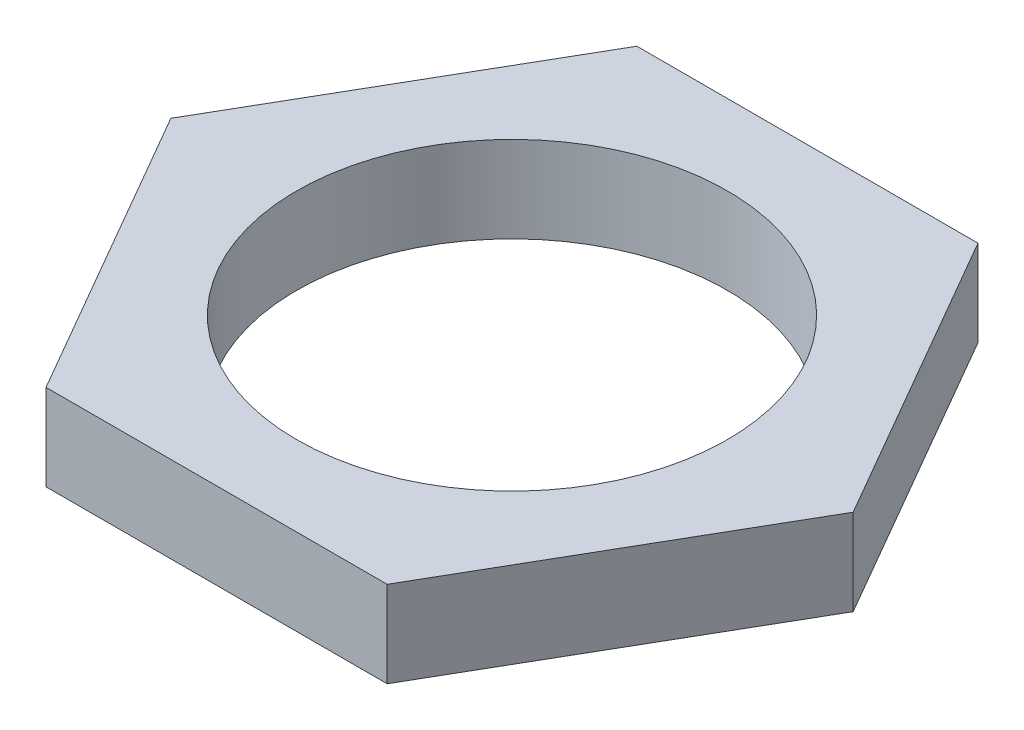
ISO-10303-21;
HEADER;
FILE_DESCRIPTION(('STEP AP214'),'2;1');
FILE_NAME('part.step','',(''),(''),'','','');
FILE_SCHEMA(('AUTOMOTIVE_DESIGN { 1 0 10303 214 1 1 1 1 }'));
ENDSEC;
DATA;
#1=APPLICATION_CONTEXT('core data for automotive mechanical design processes');
#2=APPLICATION_PROTOCOL_DEFINITION('international standard','automotive_design',2000,#1);
#3=PRODUCT_CONTEXT('',#1,'mechanical');
#4=PRODUCT('Part','Part','',(#3));
#5=PRODUCT_RELATED_PRODUCT_CATEGORY('part','',(#4));
#6=PRODUCT_DEFINITION_FORMATION('','',#4);
#7=PRODUCT_DEFINITION_CONTEXT('part definition',#1,'design');
#8=PRODUCT_DEFINITION('design','',#6,#7);
#9=PRODUCT_DEFINITION_SHAPE('','',#8);
#10=(LENGTH_UNIT() NAMED_UNIT(*) SI_UNIT(.MILLI.,.METRE.));
#11=(NAMED_UNIT(*) PLANE_ANGLE_UNIT() SI_UNIT($,.RADIAN.));
#12=(NAMED_UNIT(*) SI_UNIT($,.STERADIAN.) SOLID_ANGLE_UNIT());
#13=UNCERTAINTY_MEASURE_WITH_UNIT(LENGTH_MEASURE(1.E-05),#10,'distance_accuracy_value','');
#14=(GEOMETRIC_REPRESENTATION_CONTEXT(3) GLOBAL_UNCERTAINTY_ASSIGNED_CONTEXT((#13)) GLOBAL_UNIT_ASSIGNED_CONTEXT((#10,
#11,#12)) REPRESENTATION_CONTEXT('',''));
#15=CARTESIAN_POINT('',(0.,0.,0.));
#16=DIRECTION('',(0.,0.,1.));
#17=DIRECTION('',(1.,0.,0.));
#18=AXIS2_PLACEMENT_3D('',#15,#16,#17);
#19=CARTESIAN_POINT('',(0.,3.5,0.));
#20=DIRECTION('',(0.,1.,0.));
#21=DIRECTION('',(0.,0.,1.));
#22=AXIS2_PLACEMENT_3D('',#19,#20,#21);
#23=PLANE('',#22);
#24=DIRECTION('',(0.5,0.,0.866025403784438));
#25=VECTOR('',#24,1.);
#26=CARTESIAN_POINT('',(-13.856406460551,3.5,0.));
#27=LINE('',#26,#25);
#28=CARTESIAN_POINT('',(-13.856406460551,3.5,0.));
#29=VERTEX_POINT('',#28);
#30=CARTESIAN_POINT('',(-6.92820323027551,3.5,12.));
#31=VERTEX_POINT('',#30);
#32=EDGE_CURVE('E135',#29,#31,#27,.T.);
#33=ORIENTED_EDGE('',*,*,#32,.T.);
#34=DIRECTION('',(1.,0.,0.));
#35=VECTOR('',#34,1.);
#36=CARTESIAN_POINT('',(-6.92820323027551,3.5,12.));
#37=LINE('',#36,#35);
#38=CARTESIAN_POINT('',(6.92820323027551,3.5,12.));
#39=VERTEX_POINT('',#38);
#40=EDGE_CURVE('E93',#31,#39,#37,.T.);
#41=ORIENTED_EDGE('',*,*,#40,.T.);
#42=DIRECTION('',(0.5,0.,-0.866025403784439));
#43=VECTOR('',#42,1.);
#44=CARTESIAN_POINT('',(6.92820323027551,3.5,12.));
#45=LINE('',#44,#43);
#46=CARTESIAN_POINT('',(13.856406460551,3.5,0.));
#47=VERTEX_POINT('',#46);
#48=EDGE_CURVE('E106',#39,#47,#45,.T.);
#49=ORIENTED_EDGE('',*,*,#48,.T.);
#50=DIRECTION('',(-0.5,0.,-0.866025403784439));
#51=VECTOR('',#50,1.);
#52=CARTESIAN_POINT('',(13.856406460551,3.5,0.));
#53=LINE('',#52,#51);
#54=CARTESIAN_POINT('',(6.92820323027551,3.5,-12.));
#55=VERTEX_POINT('',#54);
#56=EDGE_CURVE('E100',#47,#55,#53,.T.);
#57=ORIENTED_EDGE('',*,*,#56,.T.);
#58=DIRECTION('',(-1.,0.,0.));
#59=VECTOR('',#58,1.);
#60=CARTESIAN_POINT('',(6.92820323027551,3.5,-12.));
#61=LINE('',#60,#59);
#62=CARTESIAN_POINT('',(-6.92820323027551,3.5,-12.));
#63=VERTEX_POINT('',#62);
#64=EDGE_CURVE('E104',#55,#63,#61,.T.);
#65=ORIENTED_EDGE('',*,*,#64,.T.);
#66=DIRECTION('',(-0.5,0.,0.866025403784439));
#67=VECTOR('',#66,1.);
#68=CARTESIAN_POINT('',(-6.92820323027551,3.5,-12.));
#69=LINE('',#68,#67);
#70=EDGE_CURVE('E56',#63,#29,#69,.T.);
#71=ORIENTED_EDGE('',*,*,#70,.T.);
#72=EDGE_LOOP('',(#33,#41,#49,#57,#65,#71));
#73=FACE_BOUND('',#72,.T.);
#74=CARTESIAN_POINT('',(0.,3.5,0.));
#75=DIRECTION('',(0.,1.,0.));
#76=DIRECTION('',(0.,0.,1.));
#77=AXIS2_PLACEMENT_3D('',#74,#75,#76);
#78=CIRCLE('',#77,8.75);
#79=CARTESIAN_POINT('',(0.,3.5,8.75));
#80=VERTEX_POINT('',#79);
#81=EDGE_CURVE('E128',#80,#80,#78,.T.);
#82=ORIENTED_EDGE('',*,*,#81,.F.);
#83=EDGE_LOOP('',(#82));
#84=FACE_BOUND('',#83,.T.);
#85=ADVANCED_FACE('F39',(#73,#84),#23,.T.);
#86=CARTESIAN_POINT('',(0.,0.,0.));
#87=DIRECTION('',(0.,1.,0.));
#88=DIRECTION('',(0.,0.,1.));
#89=AXIS2_PLACEMENT_3D('',#86,#87,#88);
#90=PLANE('',#89);
#91=DIRECTION('',(0.5,0.,0.866025403784438));
#92=VECTOR('',#91,1.);
#93=CARTESIAN_POINT('',(-13.856406460551,0.,0.));
#94=LINE('',#93,#92);
#95=CARTESIAN_POINT('',(-13.856406460551,0.,0.));
#96=VERTEX_POINT('',#95);
#97=CARTESIAN_POINT('',(-6.92820323027551,0.,12.));
#98=VERTEX_POINT('',#97);
#99=EDGE_CURVE('E124',#96,#98,#94,.T.);
#100=ORIENTED_EDGE('',*,*,#99,.F.);
#101=DIRECTION('',(-0.5,0.,0.866025403784439));
#102=VECTOR('',#101,1.);
#103=CARTESIAN_POINT('',(-6.92820323027551,0.,-12.));
#104=LINE('',#103,#102);
#105=CARTESIAN_POINT('',(-6.92820323027551,0.,-12.));
#106=VERTEX_POINT('',#105);
#107=EDGE_CURVE('E85',#106,#96,#104,.T.);
#108=ORIENTED_EDGE('',*,*,#107,.F.);
#109=DIRECTION('',(-1.,0.,0.));
#110=VECTOR('',#109,1.);
#111=CARTESIAN_POINT('',(6.92820323027551,0.,-12.));
#112=LINE('',#111,#110);
#113=CARTESIAN_POINT('',(6.92820323027551,0.,-12.));
#114=VERTEX_POINT('',#113);
#115=EDGE_CURVE('E79',#114,#106,#112,.T.);
#116=ORIENTED_EDGE('',*,*,#115,.F.);
#117=DIRECTION('',(-0.5,0.,-0.866025403784439));
#118=VECTOR('',#117,1.);
#119=CARTESIAN_POINT('',(13.856406460551,0.,0.));
#120=LINE('',#119,#118);
#121=CARTESIAN_POINT('',(13.856406460551,0.,0.));
#122=VERTEX_POINT('',#121);
#123=EDGE_CURVE('E114',#122,#114,#120,.T.);
#124=ORIENTED_EDGE('',*,*,#123,.F.);
#125=DIRECTION('',(0.5,0.,-0.866025403784439));
#126=VECTOR('',#125,1.);
#127=CARTESIAN_POINT('',(6.92820323027551,0.,12.));
#128=LINE('',#127,#126);
#129=CARTESIAN_POINT('',(6.92820323027551,0.,12.));
#130=VERTEX_POINT('',#129);
#131=EDGE_CURVE('E130',#130,#122,#128,.T.);
#132=ORIENTED_EDGE('',*,*,#131,.F.);
#133=DIRECTION('',(1.,0.,0.));
#134=VECTOR('',#133,1.);
#135=CARTESIAN_POINT('',(-6.92820323027551,0.,12.));
#136=LINE('',#135,#134);
#137=EDGE_CURVE('E127',#98,#130,#136,.T.);
#138=ORIENTED_EDGE('',*,*,#137,.F.);
#139=EDGE_LOOP('',(#100,#108,#116,#124,#132,#138));
#140=FACE_BOUND('',#139,.T.);
#141=CARTESIAN_POINT('',(0.,0.,0.));
#142=DIRECTION('',(0.,1.,0.));
#143=DIRECTION('',(0.,0.,1.));
#144=AXIS2_PLACEMENT_3D('',#141,#142,#143);
#145=CIRCLE('',#144,8.75);
#146=CARTESIAN_POINT('',(0.,0.,8.75));
#147=VERTEX_POINT('',#146);
#148=EDGE_CURVE('E210',#147,#147,#145,.T.);
#149=ORIENTED_EDGE('',*,*,#148,.T.);
#150=EDGE_LOOP('',(#149));
#151=FACE_BOUND('',#150,.T.);
#152=ADVANCED_FACE('F144',(#140,#151),#90,.F.);
#153=CARTESIAN_POINT('',(-13.856406460551,3.5,0.));
#154=DIRECTION('',(0.866025403784438,0.,-0.5));
#155=DIRECTION('',(-0.5,0.,-0.866025403784439));
#156=AXIS2_PLACEMENT_3D('',#153,#154,#155);
#157=PLANE('',#156);
#158=ORIENTED_EDGE('',*,*,#99,.T.);
#159=DIRECTION('',(0.,-1.,0.));
#160=VECTOR('',#159,1.);
#161=CARTESIAN_POINT('',(-6.92820323027551,3.5,12.));
#162=LINE('',#161,#160);
#163=EDGE_CURVE('E11',#31,#98,#162,.T.);
#164=ORIENTED_EDGE('',*,*,#163,.F.);
#165=ORIENTED_EDGE('',*,*,#32,.F.);
#166=DIRECTION('',(0.,-1.,0.));
#167=VECTOR('',#166,1.);
#168=CARTESIAN_POINT('',(-13.856406460551,3.5,0.));
#169=LINE('',#168,#167);
#170=EDGE_CURVE('E120',#29,#96,#169,.T.);
#171=ORIENTED_EDGE('',*,*,#170,.T.);
#172=EDGE_LOOP('',(#158,#164,#165,#171));
#173=FACE_BOUND('',#172,.T.);
#174=ADVANCED_FACE('F41',(#173),#157,.F.);
#175=CARTESIAN_POINT('',(-6.92820323027551,3.5,12.));
#176=DIRECTION('',(0.,0.,-1.));
#177=DIRECTION('',(-1.,0.,0.));
#178=AXIS2_PLACEMENT_3D('',#175,#176,#177);
#179=PLANE('',#178);
#180=ORIENTED_EDGE('',*,*,#137,.T.);
#181=DIRECTION('',(0.,-1.,0.));
#182=VECTOR('',#181,1.);
#183=CARTESIAN_POINT('',(6.92820323027551,3.5,12.));
#184=LINE('',#183,#182);
#185=EDGE_CURVE('E48',#39,#130,#184,.T.);
#186=ORIENTED_EDGE('',*,*,#185,.F.);
#187=ORIENTED_EDGE('',*,*,#40,.F.);
#188=ORIENTED_EDGE('',*,*,#163,.T.);
#189=EDGE_LOOP('',(#180,#186,#187,#188));
#190=FACE_BOUND('',#189,.T.);
#191=ADVANCED_FACE('F169',(#190),#179,.F.);
#192=CARTESIAN_POINT('',(6.92820323027551,3.5,12.));
#193=DIRECTION('',(-0.866025403784439,0.,-0.5));
#194=DIRECTION('',(-0.5,0.,0.866025403784439));
#195=AXIS2_PLACEMENT_3D('',#192,#193,#194);
#196=PLANE('',#195);
#197=ORIENTED_EDGE('',*,*,#131,.T.);
#198=DIRECTION('',(0.,-1.,0.));
#199=VECTOR('',#198,1.);
#200=CARTESIAN_POINT('',(13.856406460551,3.5,0.));
#201=LINE('',#200,#199);
#202=EDGE_CURVE('E115',#47,#122,#201,.T.);
#203=ORIENTED_EDGE('',*,*,#202,.F.);
#204=ORIENTED_EDGE('',*,*,#48,.F.);
#205=ORIENTED_EDGE('',*,*,#185,.T.);
#206=EDGE_LOOP('',(#197,#203,#204,#205));
#207=FACE_BOUND('',#206,.T.);
#208=ADVANCED_FACE('F141',(#207),#196,.F.);
#209=CARTESIAN_POINT('',(13.856406460551,3.5,0.));
#210=DIRECTION('',(-0.866025403784439,0.,0.5));
#211=DIRECTION('',(0.5,0.,0.866025403784439));
#212=AXIS2_PLACEMENT_3D('',#209,#210,#211);
#213=PLANE('',#212);
#214=ORIENTED_EDGE('',*,*,#123,.T.);
#215=DIRECTION('',(0.,-1.,0.));
#216=VECTOR('',#215,1.);
#217=CARTESIAN_POINT('',(6.92820323027551,3.5,-12.));
#218=LINE('',#217,#216);
#219=EDGE_CURVE('E111',#55,#114,#218,.T.);
#220=ORIENTED_EDGE('',*,*,#219,.F.);
#221=ORIENTED_EDGE('',*,*,#56,.F.);
#222=ORIENTED_EDGE('',*,*,#202,.T.);
#223=EDGE_LOOP('',(#214,#220,#221,#222));
#224=FACE_BOUND('',#223,.T.);
#225=ADVANCED_FACE('F112',(#224),#213,.F.);
#226=CARTESIAN_POINT('',(6.92820323027551,3.5,-12.));
#227=DIRECTION('',(0.,0.,1.));
#228=DIRECTION('',(1.,0.,0.));
#229=AXIS2_PLACEMENT_3D('',#226,#227,#228);
#230=PLANE('',#229);
#231=ORIENTED_EDGE('',*,*,#115,.T.);
#232=DIRECTION('',(0.,-1.,0.));
#233=VECTOR('',#232,1.);
#234=CARTESIAN_POINT('',(-6.92820323027551,3.5,-12.));
#235=LINE('',#234,#233);
#236=EDGE_CURVE('E116',#63,#106,#235,.T.);
#237=ORIENTED_EDGE('',*,*,#236,.F.);
#238=ORIENTED_EDGE('',*,*,#64,.F.);
#239=ORIENTED_EDGE('',*,*,#219,.T.);
#240=EDGE_LOOP('',(#231,#237,#238,#239));
#241=FACE_BOUND('',#240,.T.);
#242=ADVANCED_FACE('F118',(#241),#230,.F.);
#243=CARTESIAN_POINT('',(-6.92820323027551,3.5,-12.));
#244=DIRECTION('',(0.866025403784439,0.,0.5));
#245=DIRECTION('',(0.5,0.,-0.866025403784439));
#246=AXIS2_PLACEMENT_3D('',#243,#244,#245);
#247=PLANE('',#246);
#248=ORIENTED_EDGE('',*,*,#107,.T.);
#249=ORIENTED_EDGE('',*,*,#170,.F.);
#250=ORIENTED_EDGE('',*,*,#70,.F.);
#251=ORIENTED_EDGE('',*,*,#236,.T.);
#252=EDGE_LOOP('',(#248,#249,#250,#251));
#253=FACE_BOUND('',#252,.T.);
#254=ADVANCED_FACE('F149',(#253),#247,.F.);
#255=CARTESIAN_POINT('',(0.,3.5,0.));
#256=DIRECTION('',(0.,-1.,0.));
#257=DIRECTION('',(0.,0.,-1.));
#258=AXIS2_PLACEMENT_3D('',#255,#256,#257);
#259=CYLINDRICAL_SURFACE('',#258,8.75);
#260=ORIENTED_EDGE('',*,*,#81,.T.);
#261=EDGE_LOOP('',(#260));
#262=FACE_BOUND('',#261,.T.);
#263=ORIENTED_EDGE('',*,*,#148,.F.);
#264=EDGE_LOOP('',(#263));
#265=FACE_BOUND('',#264,.T.);
#266=ADVANCED_FACE('F151',(#262,#265),#259,.F.);
#267=CLOSED_SHELL('',(#85,#152,#174,#191,#208,#225,#242,#254,#266));
#268=MANIFOLD_SOLID_BREP('B2',#267);
#269=ADVANCED_BREP_SHAPE_REPRESENTATION('',(#18,#268),#14);
#270=SHAPE_DEFINITION_REPRESENTATION(#9,#269);
ENDSEC;
END-ISO-10303-21;
